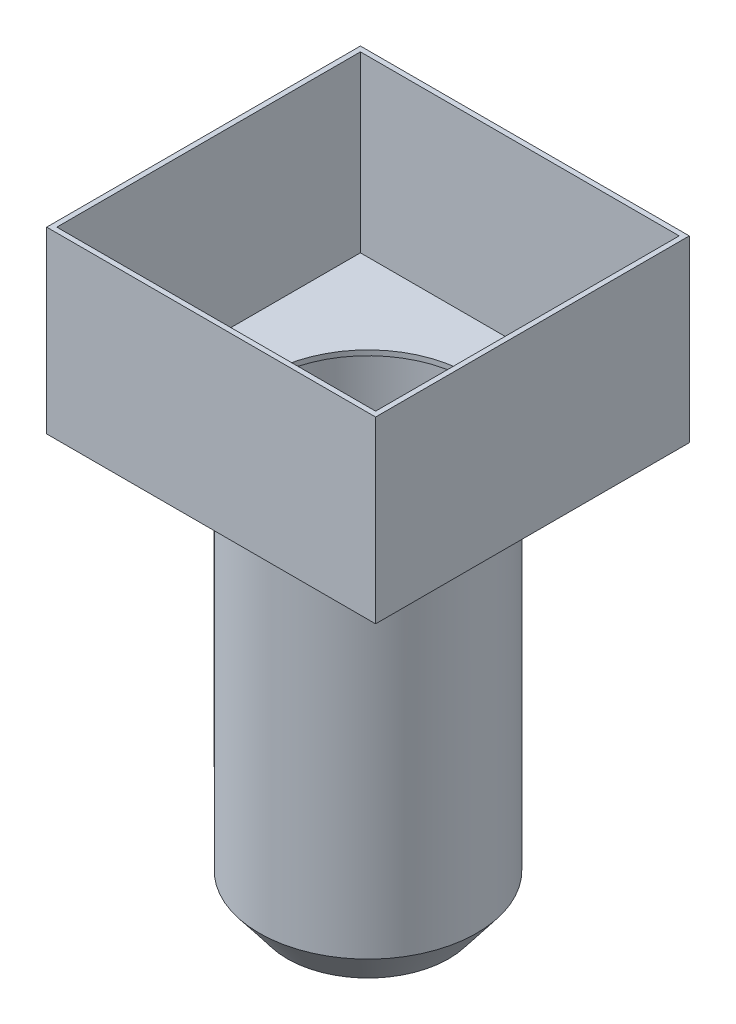
ISO-10303-21;
HEADER;
FILE_DESCRIPTION(('STEP AP214'),'2;1');
FILE_NAME('part.step','',(''),(''),'','','');
FILE_SCHEMA(('AUTOMOTIVE_DESIGN { 1 0 10303 214 1 1 1 1 }'));
ENDSEC;
DATA;
#1=APPLICATION_CONTEXT('core data for automotive mechanical design processes');
#2=APPLICATION_PROTOCOL_DEFINITION('international standard','automotive_design',2000,#1);
#3=PRODUCT_CONTEXT('',#1,'mechanical');
#4=PRODUCT('Part','Part','',(#3));
#5=PRODUCT_RELATED_PRODUCT_CATEGORY('part','',(#4));
#6=PRODUCT_DEFINITION_FORMATION('','',#4);
#7=PRODUCT_DEFINITION_CONTEXT('part definition',#1,'design');
#8=PRODUCT_DEFINITION('design','',#6,#7);
#9=PRODUCT_DEFINITION_SHAPE('','',#8);
#10=(LENGTH_UNIT() NAMED_UNIT(*) SI_UNIT(.MILLI.,.METRE.));
#11=(NAMED_UNIT(*) PLANE_ANGLE_UNIT() SI_UNIT($,.RADIAN.));
#12=(NAMED_UNIT(*) SI_UNIT($,.STERADIAN.) SOLID_ANGLE_UNIT());
#13=UNCERTAINTY_MEASURE_WITH_UNIT(LENGTH_MEASURE(1.E-05),#10,'distance_accuracy_value','');
#14=(GEOMETRIC_REPRESENTATION_CONTEXT(3) GLOBAL_UNCERTAINTY_ASSIGNED_CONTEXT((#13)) GLOBAL_UNIT_ASSIGNED_CONTEXT((#10,
#11,#12)) REPRESENTATION_CONTEXT('',''));
#15=CARTESIAN_POINT('',(0.,0.,0.));
#16=DIRECTION('',(0.,0.,1.));
#17=DIRECTION('',(1.,0.,0.));
#18=AXIS2_PLACEMENT_3D('',#15,#16,#17);
#19=CARTESIAN_POINT('',(0.,3.54,-3.1));
#20=DIRECTION('',(0.,-1.,0.));
#21=DIRECTION('',(1.,0.,0.));
#22=AXIS2_PLACEMENT_3D('',#19,#20,#21);
#23=PLANE('',#22);
#24=DIRECTION('',(0.,0.,1.));
#25=VECTOR('',#24,1.);
#26=CARTESIAN_POINT('',(-3.25,3.54,-3.1));
#27=LINE('',#26,#25);
#28=CARTESIAN_POINT('',(-3.25,3.54,-3.1));
#29=VERTEX_POINT('',#28);
#30=CARTESIAN_POINT('',(-3.25,3.54,3.1));
#31=VERTEX_POINT('',#30);
#32=EDGE_CURVE('E190',#29,#31,#27,.T.);
#33=ORIENTED_EDGE('',*,*,#32,.T.);
#34=DIRECTION('',(1.,0.,0.));
#35=VECTOR('',#34,1.);
#36=CARTESIAN_POINT('',(0.,3.54,3.1));
#37=LINE('',#36,#35);
#38=CARTESIAN_POINT('',(3.25,3.54,3.1));
#39=VERTEX_POINT('',#38);
#40=EDGE_CURVE('E159',#31,#39,#37,.T.);
#41=ORIENTED_EDGE('',*,*,#40,.T.);
#42=DIRECTION('',(0.,0.,1.));
#43=VECTOR('',#42,1.);
#44=CARTESIAN_POINT('',(3.25,3.54,-3.1));
#45=LINE('',#44,#43);
#46=CARTESIAN_POINT('',(3.25,3.54,-3.1));
#47=VERTEX_POINT('',#46);
#48=EDGE_CURVE('E191',#47,#39,#45,.T.);
#49=ORIENTED_EDGE('',*,*,#48,.F.);
#50=DIRECTION('',(1.,0.,0.));
#51=VECTOR('',#50,1.);
#52=CARTESIAN_POINT('',(0.,3.54,-3.1));
#53=LINE('',#52,#51);
#54=EDGE_CURVE('E178',#29,#47,#53,.T.);
#55=ORIENTED_EDGE('',*,*,#54,.F.);
#56=EDGE_LOOP('',(#33,#41,#49,#55));
#57=FACE_BOUND('',#56,.T.);
#58=DIRECTION('',(0.,0.,1.));
#59=VECTOR('',#58,1.);
#60=CARTESIAN_POINT('',(-3.15,3.54,-3.1));
#61=LINE('',#60,#59);
#62=CARTESIAN_POINT('',(-3.15,3.54,-3.));
#63=VERTEX_POINT('',#62);
#64=CARTESIAN_POINT('',(-3.15,3.54,3.));
#65=VERTEX_POINT('',#64);
#66=EDGE_CURVE('E154',#63,#65,#61,.T.);
#67=ORIENTED_EDGE('',*,*,#66,.F.);
#68=DIRECTION('',(1.,0.,0.));
#69=VECTOR('',#68,1.);
#70=CARTESIAN_POINT('',(0.,3.54,-3.));
#71=LINE('',#70,#69);
#72=CARTESIAN_POINT('',(3.15,3.54,-3.));
#73=VERTEX_POINT('',#72);
#74=EDGE_CURVE('E140',#63,#73,#71,.T.);
#75=ORIENTED_EDGE('',*,*,#74,.T.);
#76=DIRECTION('',(0.,0.,1.));
#77=VECTOR('',#76,1.);
#78=CARTESIAN_POINT('',(3.15,3.54,-3.1));
#79=LINE('',#78,#77);
#80=CARTESIAN_POINT('',(3.15,3.54,3.));
#81=VERTEX_POINT('',#80);
#82=EDGE_CURVE('E66',#73,#81,#79,.T.);
#83=ORIENTED_EDGE('',*,*,#82,.T.);
#84=DIRECTION('',(1.,0.,0.));
#85=VECTOR('',#84,1.);
#86=CARTESIAN_POINT('',(0.,3.54,3.));
#87=LINE('',#86,#85);
#88=EDGE_CURVE('E138',#65,#81,#87,.T.);
#89=ORIENTED_EDGE('',*,*,#88,.F.);
#90=EDGE_LOOP('',(#67,#75,#83,#89));
#91=FACE_BOUND('',#90,.T.);
#92=ADVANCED_FACE('F49',(#57,#91),#23,.F.);
#93=CARTESIAN_POINT('',(0.,19.4407474960869,0.));
#94=DIRECTION('',(0.,1.,0.));
#95=DIRECTION('',(0.,0.,1.));
#96=AXIS2_PLACEMENT_3D('',#93,#94,#95);
#97=CYLINDRICAL_SURFACE('',#96,2.15);
#98=CARTESIAN_POINT('',(0.,-7.39417001328128,0.));
#99=DIRECTION('',(0.,1.,0.));
#100=DIRECTION('',(0.,0.,1.));
#101=AXIS2_PLACEMENT_3D('',#98,#99,#100);
#102=CIRCLE('',#101,2.15);
#103=CARTESIAN_POINT('',(0.,-7.39417001328128,2.15));
#104=VERTEX_POINT('',#103);
#105=EDGE_CURVE('E59',#104,#104,#102,.T.);
#106=ORIENTED_EDGE('',*,*,#105,.T.);
#107=EDGE_LOOP('',(#106));
#108=FACE_BOUND('',#107,.T.);
#109=CARTESIAN_POINT('',(0.,0.,0.));
#110=DIRECTION('',(0.,-1.,0.));
#111=DIRECTION('',(0.,0.,-1.));
#112=AXIS2_PLACEMENT_3D('',#109,#110,#111);
#113=CIRCLE('',#112,2.15);
#114=CARTESIAN_POINT('',(0.,0.,-2.15));
#115=VERTEX_POINT('',#114);
#116=EDGE_CURVE('E11',#115,#115,#113,.F.);
#117=ORIENTED_EDGE('',*,*,#116,.F.);
#118=EDGE_LOOP('',(#117));
#119=FACE_BOUND('',#118,.T.);
#120=ADVANCED_FACE('F236',(#108,#119),#97,.T.);
#121=CARTESIAN_POINT('',(0.,-7.42119496483995,0.));
#122=DIRECTION('',(0.,1.,0.));
#123=DIRECTION('',(0.,0.,1.));
#124=AXIS2_PLACEMENT_3D('',#121,#122,#123);
#125=CONICAL_SURFACE('',#124,2.12908967238671,0.658523358192979);
#126=CARTESIAN_POINT('',(0.,-8.11,0.));
#127=DIRECTION('',(0.,1.,0.));
#128=DIRECTION('',(0.,0.,1.));
#129=AXIS2_PLACEMENT_3D('',#126,#127,#128);
#130=CIRCLE('',#129,1.59613260433746);
#131=CARTESIAN_POINT('',(0.,-8.11,1.59613260433746));
#132=VERTEX_POINT('',#131);
#133=EDGE_CURVE('E53',#132,#132,#130,.T.);
#134=ORIENTED_EDGE('',*,*,#133,.T.);
#135=EDGE_LOOP('',(#134));
#136=FACE_BOUND('',#135,.T.);
#137=ORIENTED_EDGE('',*,*,#105,.F.);
#138=EDGE_LOOP('',(#137));
#139=FACE_BOUND('',#138,.T.);
#140=ADVANCED_FACE('F51',(#136,#139),#125,.T.);
#141=CARTESIAN_POINT('',(0.,-8.11,0.));
#142=DIRECTION('',(0.,1.,0.));
#143=DIRECTION('',(0.,0.,1.));
#144=AXIS2_PLACEMENT_3D('',#141,#142,#143);
#145=PLANE('',#144);
#146=CARTESIAN_POINT('',(0.,-8.11,0.));
#147=DIRECTION('',(0.,1.,0.));
#148=DIRECTION('',(0.,0.,1.));
#149=AXIS2_PLACEMENT_3D('',#146,#147,#148);
#150=CIRCLE('',#149,1.4696938456699);
#151=CARTESIAN_POINT('',(0.,-8.11,1.4696938456699));
#152=VERTEX_POINT('',#151);
#153=EDGE_CURVE('E203',#152,#152,#150,.T.);
#154=ORIENTED_EDGE('',*,*,#153,.T.);
#155=EDGE_LOOP('',(#154));
#156=FACE_BOUND('',#155,.T.);
#157=ORIENTED_EDGE('',*,*,#133,.F.);
#158=EDGE_LOOP('',(#157));
#159=FACE_BOUND('',#158,.T.);
#160=ADVANCED_FACE('F224',(#156,#159),#145,.F.);
#161=CARTESIAN_POINT('',(0.,19.4407474960869,0.));
#162=DIRECTION('',(0.,1.,0.));
#163=DIRECTION('',(0.,0.,1.));
#164=AXIS2_PLACEMENT_3D('',#161,#162,#163);
#165=CYLINDRICAL_SURFACE('',#164,2.05);
#166=CARTESIAN_POINT('',(0.,-7.36,0.));
#167=DIRECTION('',(0.,1.,0.));
#168=DIRECTION('',(0.,0.,1.));
#169=AXIS2_PLACEMENT_3D('',#166,#167,#168);
#170=CIRCLE('',#169,2.05);
#171=CARTESIAN_POINT('',(0.,-7.36,2.05));
#172=VERTEX_POINT('',#171);
#173=EDGE_CURVE('E207',#172,#172,#170,.T.);
#174=ORIENTED_EDGE('',*,*,#173,.F.);
#175=EDGE_LOOP('',(#174));
#176=FACE_BOUND('',#175,.T.);
#177=CARTESIAN_POINT('',(0.,0.,0.));
#178=DIRECTION('',(0.,1.,0.));
#179=DIRECTION('',(0.,0.,1.));
#180=AXIS2_PLACEMENT_3D('',#177,#178,#179);
#181=CIRCLE('',#180,2.05);
#182=CARTESIAN_POINT('',(0.,0.,2.05));
#183=VERTEX_POINT('',#182);
#184=EDGE_CURVE('E194',#183,#183,#181,.T.);
#185=ORIENTED_EDGE('',*,*,#184,.T.);
#186=EDGE_LOOP('',(#185));
#187=FACE_BOUND('',#186,.T.);
#188=ADVANCED_FACE('F226',(#176,#187),#165,.F.);
#189=CARTESIAN_POINT('',(0.,-7.36,0.));
#190=DIRECTION('',(0.,1.,0.));
#191=DIRECTION('',(0.,0.,1.));
#192=AXIS2_PLACEMENT_3D('',#189,#190,#191);
#193=CONICAL_SURFACE('',#192,2.05,0.658523358192979);
#194=ORIENTED_EDGE('',*,*,#153,.F.);
#195=EDGE_LOOP('',(#194));
#196=FACE_BOUND('',#195,.T.);
#197=ORIENTED_EDGE('',*,*,#173,.T.);
#198=EDGE_LOOP('',(#197));
#199=FACE_BOUND('',#198,.T.);
#200=ADVANCED_FACE('F233',(#196,#199),#193,.F.);
#201=CARTESIAN_POINT('',(0.,0.,3.1));
#202=DIRECTION('',(0.,0.,1.));
#203=DIRECTION('',(1.,0.,0.));
#204=AXIS2_PLACEMENT_3D('',#201,#202,#203);
#205=PLANE('',#204);
#206=ORIENTED_EDGE('',*,*,#40,.F.);
#207=DIRECTION('',(0.,1.,0.));
#208=VECTOR('',#207,1.);
#209=CARTESIAN_POINT('',(-3.25,0.,3.1));
#210=LINE('',#209,#208);
#211=CARTESIAN_POINT('',(-3.25,0.,3.1));
#212=VERTEX_POINT('',#211);
#213=EDGE_CURVE('E166',#212,#31,#210,.T.);
#214=ORIENTED_EDGE('',*,*,#213,.F.);
#215=DIRECTION('',(1.,0.,0.));
#216=VECTOR('',#215,1.);
#217=CARTESIAN_POINT('',(0.,0.,3.1));
#218=LINE('',#217,#216);
#219=CARTESIAN_POINT('',(3.25,0.,3.1));
#220=VERTEX_POINT('',#219);
#221=EDGE_CURVE('E170',#212,#220,#218,.T.);
#222=ORIENTED_EDGE('',*,*,#221,.T.);
#223=DIRECTION('',(0.,-1.,0.));
#224=VECTOR('',#223,1.);
#225=CARTESIAN_POINT('',(3.25,0.,3.1));
#226=LINE('',#225,#224);
#227=EDGE_CURVE('E174',#39,#220,#226,.T.);
#228=ORIENTED_EDGE('',*,*,#227,.F.);
#229=EDGE_LOOP('',(#206,#214,#222,#228));
#230=FACE_BOUND('',#229,.T.);
#231=ADVANCED_FACE('F251',(#230),#205,.T.);
#232=CARTESIAN_POINT('',(0.,0.,-3.1));
#233=DIRECTION('',(0.,0.,1.));
#234=DIRECTION('',(1.,0.,0.));
#235=AXIS2_PLACEMENT_3D('',#232,#233,#234);
#236=PLANE('',#235);
#237=ORIENTED_EDGE('',*,*,#54,.T.);
#238=DIRECTION('',(0.,-1.,0.));
#239=VECTOR('',#238,1.);
#240=CARTESIAN_POINT('',(3.25,0.,-3.1));
#241=LINE('',#240,#239);
#242=CARTESIAN_POINT('',(3.25,0.,-3.1));
#243=VERTEX_POINT('',#242);
#244=EDGE_CURVE('E74',#47,#243,#241,.T.);
#245=ORIENTED_EDGE('',*,*,#244,.T.);
#246=DIRECTION('',(1.,0.,0.));
#247=VECTOR('',#246,1.);
#248=CARTESIAN_POINT('',(0.,0.,-3.1));
#249=LINE('',#248,#247);
#250=CARTESIAN_POINT('',(-3.25,0.,-3.1));
#251=VERTEX_POINT('',#250);
#252=EDGE_CURVE('E184',#251,#243,#249,.T.);
#253=ORIENTED_EDGE('',*,*,#252,.F.);
#254=DIRECTION('',(0.,1.,0.));
#255=VECTOR('',#254,1.);
#256=CARTESIAN_POINT('',(-3.25,0.,-3.1));
#257=LINE('',#256,#255);
#258=EDGE_CURVE('E181',#251,#29,#257,.T.);
#259=ORIENTED_EDGE('',*,*,#258,.T.);
#260=EDGE_LOOP('',(#237,#245,#253,#259));
#261=FACE_BOUND('',#260,.T.);
#262=ADVANCED_FACE('F256',(#261),#236,.F.);
#263=CARTESIAN_POINT('',(-3.25,0.,-3.1));
#264=DIRECTION('',(1.,0.,0.));
#265=DIRECTION('',(0.,1.,0.));
#266=AXIS2_PLACEMENT_3D('',#263,#264,#265);
#267=PLANE('',#266);
#268=DIRECTION('',(0.,0.,1.));
#269=VECTOR('',#268,1.);
#270=CARTESIAN_POINT('',(-3.25,0.,-3.1));
#271=LINE('',#270,#269);
#272=EDGE_CURVE('E198',#251,#212,#271,.T.);
#273=ORIENTED_EDGE('',*,*,#272,.T.);
#274=ORIENTED_EDGE('',*,*,#213,.T.);
#275=ORIENTED_EDGE('',*,*,#32,.F.);
#276=ORIENTED_EDGE('',*,*,#258,.F.);
#277=EDGE_LOOP('',(#273,#274,#275,#276));
#278=FACE_BOUND('',#277,.T.);
#279=ADVANCED_FACE('F248',(#278),#267,.F.);
#280=CARTESIAN_POINT('',(0.,0.,-3.1));
#281=DIRECTION('',(0.,-1.,0.));
#282=DIRECTION('',(1.,0.,0.));
#283=AXIS2_PLACEMENT_3D('',#280,#281,#282);
#284=PLANE('',#283);
#285=ORIENTED_EDGE('',*,*,#116,.T.);
#286=EDGE_LOOP('',(#285));
#287=FACE_BOUND('',#286,.T.);
#288=DIRECTION('',(0.,0.,1.));
#289=VECTOR('',#288,1.);
#290=CARTESIAN_POINT('',(3.25,0.,-3.1));
#291=LINE('',#290,#289);
#292=EDGE_CURVE('E195',#243,#220,#291,.T.);
#293=ORIENTED_EDGE('',*,*,#292,.T.);
#294=ORIENTED_EDGE('',*,*,#221,.F.);
#295=ORIENTED_EDGE('',*,*,#272,.F.);
#296=ORIENTED_EDGE('',*,*,#252,.T.);
#297=EDGE_LOOP('',(#293,#294,#295,#296));
#298=FACE_BOUND('',#297,.T.);
#299=ADVANCED_FACE('F269',(#287,#298),#284,.T.);
#300=CARTESIAN_POINT('',(3.25,0.,-3.1));
#301=DIRECTION('',(-1.,0.,0.));
#302=DIRECTION('',(0.,-1.,0.));
#303=AXIS2_PLACEMENT_3D('',#300,#301,#302);
#304=PLANE('',#303);
#305=ORIENTED_EDGE('',*,*,#48,.T.);
#306=ORIENTED_EDGE('',*,*,#227,.T.);
#307=ORIENTED_EDGE('',*,*,#292,.F.);
#308=ORIENTED_EDGE('',*,*,#244,.F.);
#309=EDGE_LOOP('',(#305,#306,#307,#308));
#310=FACE_BOUND('',#309,.T.);
#311=ADVANCED_FACE('F267',(#310),#304,.F.);
#312=CARTESIAN_POINT('',(0.,0.,0.));
#313=DIRECTION('',(0.,1.,0.));
#314=DIRECTION('',(0.,0.,1.));
#315=AXIS2_PLACEMENT_3D('',#312,#313,#314);
#316=CIRCLE('',#315,2.);
#317=CARTESIAN_POINT('',(0.,0.,2.));
#318=VERTEX_POINT('',#317);
#319=EDGE_CURVE('E157',#318,#318,#316,.T.);
#320=ORIENTED_EDGE('',*,*,#319,.T.);
#321=EDGE_LOOP('',(#320));
#322=FACE_BOUND('',#321,.T.);
#323=ORIENTED_EDGE('',*,*,#184,.F.);
#324=EDGE_LOOP('',(#323));
#325=FACE_BOUND('',#324,.T.);
#326=ADVANCED_FACE('F265',(#322,#325),#284,.T.);
#327=CARTESIAN_POINT('',(0.,0.,3.));
#328=DIRECTION('',(0.,0.,1.));
#329=DIRECTION('',(1.,0.,0.));
#330=AXIS2_PLACEMENT_3D('',#327,#328,#329);
#331=PLANE('',#330);
#332=ORIENTED_EDGE('',*,*,#88,.T.);
#333=DIRECTION('',(0.,-1.,0.));
#334=VECTOR('',#333,1.);
#335=CARTESIAN_POINT('',(3.15,0.,3.));
#336=LINE('',#335,#334);
#337=CARTESIAN_POINT('',(3.15,0.100000000000003,3.));
#338=VERTEX_POINT('',#337);
#339=EDGE_CURVE('E119',#81,#338,#336,.T.);
#340=ORIENTED_EDGE('',*,*,#339,.T.);
#341=DIRECTION('',(1.,0.,0.));
#342=VECTOR('',#341,1.);
#343=CARTESIAN_POINT('',(0.,0.100000000000001,3.));
#344=LINE('',#343,#342);
#345=CARTESIAN_POINT('',(-3.15,0.0999999999999993,3.));
#346=VERTEX_POINT('',#345);
#347=EDGE_CURVE('E128',#346,#338,#344,.T.);
#348=ORIENTED_EDGE('',*,*,#347,.F.);
#349=DIRECTION('',(0.,1.,0.));
#350=VECTOR('',#349,1.);
#351=CARTESIAN_POINT('',(-3.15,0.,3.));
#352=LINE('',#351,#350);
#353=EDGE_CURVE('E134',#346,#65,#352,.T.);
#354=ORIENTED_EDGE('',*,*,#353,.T.);
#355=EDGE_LOOP('',(#332,#340,#348,#354));
#356=FACE_BOUND('',#355,.T.);
#357=ADVANCED_FACE('F136',(#356),#331,.F.);
#358=CARTESIAN_POINT('',(0.,0.,-3.));
#359=DIRECTION('',(0.,0.,1.));
#360=DIRECTION('',(1.,0.,0.));
#361=AXIS2_PLACEMENT_3D('',#358,#359,#360);
#362=PLANE('',#361);
#363=ORIENTED_EDGE('',*,*,#74,.F.);
#364=DIRECTION('',(0.,1.,0.));
#365=VECTOR('',#364,1.);
#366=CARTESIAN_POINT('',(-3.15,0.,-3.));
#367=LINE('',#366,#365);
#368=CARTESIAN_POINT('',(-3.15,0.0999999999999993,-3.));
#369=VERTEX_POINT('',#368);
#370=EDGE_CURVE('E144',#369,#63,#367,.T.);
#371=ORIENTED_EDGE('',*,*,#370,.F.);
#372=DIRECTION('',(1.,0.,0.));
#373=VECTOR('',#372,1.);
#374=CARTESIAN_POINT('',(0.,0.100000000000001,-3.));
#375=LINE('',#374,#373);
#376=CARTESIAN_POINT('',(3.15,0.100000000000003,-3.));
#377=VERTEX_POINT('',#376);
#378=EDGE_CURVE('E151',#369,#377,#375,.T.);
#379=ORIENTED_EDGE('',*,*,#378,.T.);
#380=DIRECTION('',(0.,-1.,0.));
#381=VECTOR('',#380,1.);
#382=CARTESIAN_POINT('',(3.15,0.,-3.));
#383=LINE('',#382,#381);
#384=EDGE_CURVE('E120',#73,#377,#383,.T.);
#385=ORIENTED_EDGE('',*,*,#384,.F.);
#386=EDGE_LOOP('',(#363,#371,#379,#385));
#387=FACE_BOUND('',#386,.T.);
#388=ADVANCED_FACE('F274',(#387),#362,.T.);
#389=CARTESIAN_POINT('',(-3.15,0.,-3.1));
#390=DIRECTION('',(1.,0.,0.));
#391=DIRECTION('',(0.,1.,0.));
#392=AXIS2_PLACEMENT_3D('',#389,#390,#391);
#393=PLANE('',#392);
#394=DIRECTION('',(0.,0.,1.));
#395=VECTOR('',#394,1.);
#396=CARTESIAN_POINT('',(-3.15,0.0999999999999993,-3.1));
#397=LINE('',#396,#395);
#398=EDGE_CURVE('E125',#369,#346,#397,.T.);
#399=ORIENTED_EDGE('',*,*,#398,.F.);
#400=ORIENTED_EDGE('',*,*,#370,.T.);
#401=ORIENTED_EDGE('',*,*,#66,.T.);
#402=ORIENTED_EDGE('',*,*,#353,.F.);
#403=EDGE_LOOP('',(#399,#400,#401,#402));
#404=FACE_BOUND('',#403,.T.);
#405=ADVANCED_FACE('F302',(#404),#393,.T.);
#406=CARTESIAN_POINT('',(3.15,0.,-3.1));
#407=DIRECTION('',(-1.,0.,0.));
#408=DIRECTION('',(0.,-1.,0.));
#409=AXIS2_PLACEMENT_3D('',#406,#407,#408);
#410=PLANE('',#409);
#411=ORIENTED_EDGE('',*,*,#82,.F.);
#412=ORIENTED_EDGE('',*,*,#384,.T.);
#413=DIRECTION('',(0.,0.,1.));
#414=VECTOR('',#413,1.);
#415=CARTESIAN_POINT('',(3.15,0.100000000000003,-3.1));
#416=LINE('',#415,#414);
#417=EDGE_CURVE('E115',#377,#338,#416,.T.);
#418=ORIENTED_EDGE('',*,*,#417,.T.);
#419=ORIENTED_EDGE('',*,*,#339,.F.);
#420=EDGE_LOOP('',(#411,#412,#418,#419));
#421=FACE_BOUND('',#420,.T.);
#422=ADVANCED_FACE('F117',(#421),#410,.T.);
#423=CARTESIAN_POINT('',(0.,0.100000000000001,-3.1));
#424=DIRECTION('',(0.,-1.,0.));
#425=DIRECTION('',(1.,0.,0.));
#426=AXIS2_PLACEMENT_3D('',#423,#424,#425);
#427=PLANE('',#426);
#428=CARTESIAN_POINT('',(0.,0.100000000000001,0.));
#429=DIRECTION('',(0.,1.,0.));
#430=DIRECTION('',(0.,0.,1.));
#431=AXIS2_PLACEMENT_3D('',#428,#429,#430);
#432=CIRCLE('',#431,2.);
#433=CARTESIAN_POINT('',(0.,0.100000000000001,2.));
#434=VERTEX_POINT('',#433);
#435=EDGE_CURVE('E320',#434,#434,#432,.T.);
#436=ORIENTED_EDGE('',*,*,#435,.F.);
#437=EDGE_LOOP('',(#436));
#438=FACE_BOUND('',#437,.T.);
#439=ORIENTED_EDGE('',*,*,#417,.F.);
#440=ORIENTED_EDGE('',*,*,#378,.F.);
#441=ORIENTED_EDGE('',*,*,#398,.T.);
#442=ORIENTED_EDGE('',*,*,#347,.T.);
#443=EDGE_LOOP('',(#439,#440,#441,#442));
#444=FACE_BOUND('',#443,.T.);
#445=ADVANCED_FACE('F129',(#438,#444),#427,.F.);
#446=CARTESIAN_POINT('',(0.,0.,0.));
#447=DIRECTION('',(0.,1.,0.));
#448=DIRECTION('',(0.,0.,1.));
#449=AXIS2_PLACEMENT_3D('',#446,#447,#448);
#450=CYLINDRICAL_SURFACE('',#449,2.);
#451=ORIENTED_EDGE('',*,*,#319,.F.);
#452=EDGE_LOOP('',(#451));
#453=FACE_BOUND('',#452,.T.);
#454=ORIENTED_EDGE('',*,*,#435,.T.);
#455=EDGE_LOOP('',(#454));
#456=FACE_BOUND('',#455,.T.);
#457=ADVANCED_FACE('F304',(#453,#456),#450,.F.);
#458=CLOSED_SHELL('',(#92,#120,#140,#160,#188,#200,#231,#262,#279,#299,#311,#326,#357,#388,#405,
#422,#445,#457));
#459=MANIFOLD_SOLID_BREP('B2',#458);
#460=ADVANCED_BREP_SHAPE_REPRESENTATION('',(#18,#459),#14);
#461=SHAPE_DEFINITION_REPRESENTATION(#9,#460);
ENDSEC;
END-ISO-10303-21;
